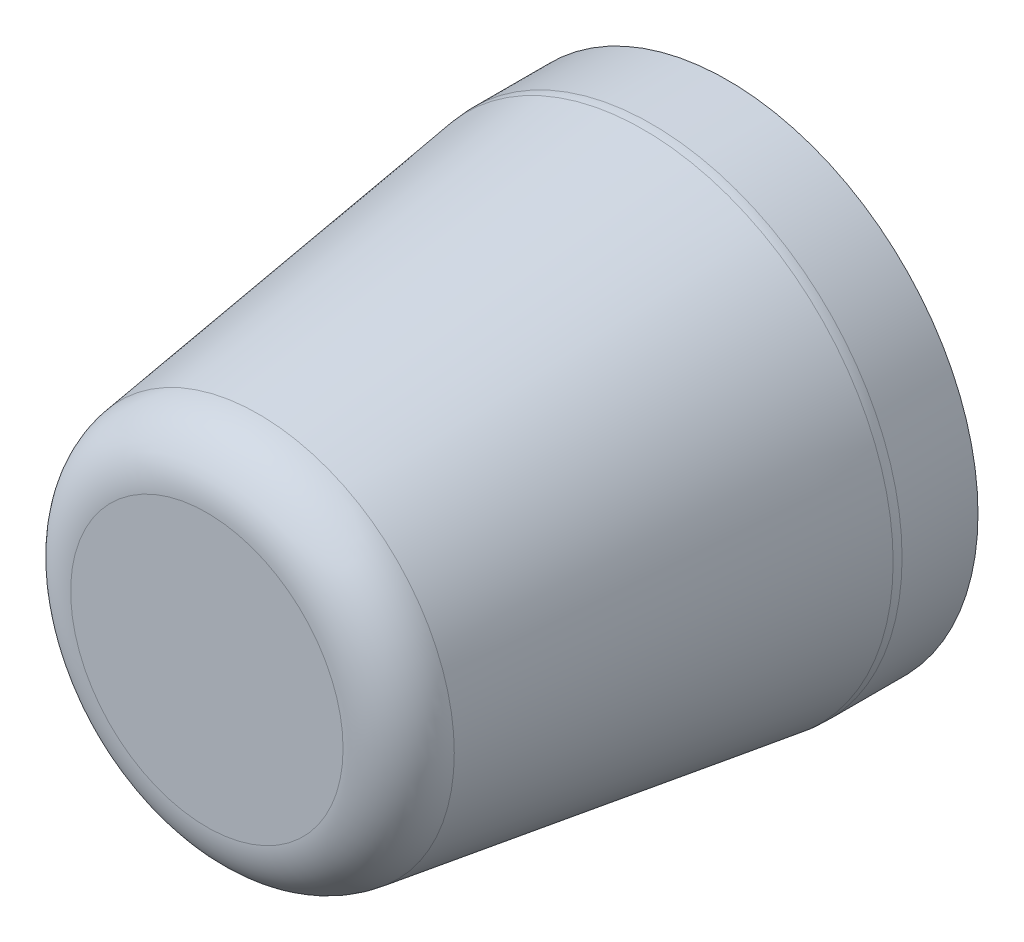
ISO-10303-21;
HEADER;
FILE_DESCRIPTION(('STEP AP214'),'2;1');
FILE_NAME('part.step','',(''),(''),'','','');
FILE_SCHEMA(('AUTOMOTIVE_DESIGN { 1 0 10303 214 1 1 1 1 }'));
ENDSEC;
DATA;
#1=APPLICATION_CONTEXT('core data for automotive mechanical design processes');
#2=APPLICATION_PROTOCOL_DEFINITION('international standard','automotive_design',2000,#1);
#3=PRODUCT_CONTEXT('',#1,'mechanical');
#4=PRODUCT('Part','Part','',(#3));
#5=PRODUCT_RELATED_PRODUCT_CATEGORY('part','',(#4));
#6=PRODUCT_DEFINITION_FORMATION('','',#4);
#7=PRODUCT_DEFINITION_CONTEXT('part definition',#1,'design');
#8=PRODUCT_DEFINITION('design','',#6,#7);
#9=PRODUCT_DEFINITION_SHAPE('','',#8);
#10=(LENGTH_UNIT() NAMED_UNIT(*) SI_UNIT(.MILLI.,.METRE.));
#11=(NAMED_UNIT(*) PLANE_ANGLE_UNIT() SI_UNIT($,.RADIAN.));
#12=(NAMED_UNIT(*) SI_UNIT($,.STERADIAN.) SOLID_ANGLE_UNIT());
#13=UNCERTAINTY_MEASURE_WITH_UNIT(LENGTH_MEASURE(1.E-05),#10,'distance_accuracy_value','');
#14=(GEOMETRIC_REPRESENTATION_CONTEXT(3) GLOBAL_UNCERTAINTY_ASSIGNED_CONTEXT((#13)) GLOBAL_UNIT_ASSIGNED_CONTEXT((#10,
#11,#12)) REPRESENTATION_CONTEXT('',''));
#15=CARTESIAN_POINT('',(0.,0.,0.));
#16=DIRECTION('',(0.,0.,1.));
#17=DIRECTION('',(1.,0.,0.));
#18=AXIS2_PLACEMENT_3D('',#15,#16,#17);
#19=CARTESIAN_POINT('',(0.,9.40810163654738,26.));
#20=DIRECTION('',(0.,0.,1.));
#21=DIRECTION('',(1.,0.,0.));
#22=AXIS2_PLACEMENT_3D('',#19,#20,#21);
#23=PLANE('',#22);
#24=CARTESIAN_POINT('',(0.,0.,26.));
#25=DIRECTION('',(0.,0.,1.));
#26=DIRECTION('',(1.,0.,0.));
#27=AXIS2_PLACEMENT_3D('',#24,#25,#26);
#28=CIRCLE('',#27,6.8002414230987);
#29=CARTESIAN_POINT('',(6.8002414230987,0.,26.));
#30=VERTEX_POINT('',#29);
#31=EDGE_CURVE('E22',#30,#30,#28,.T.);
#32=ORIENTED_EDGE('',*,*,#31,.T.);
#33=EDGE_LOOP('',(#32));
#34=FACE_BOUND('',#33,.T.);
#35=ADVANCED_FACE('F15',(#34),#23,.T.);
#36=CARTESIAN_POINT('',(0.,0.,15.));
#37=DIRECTION('',(0.,0.,-1.));
#38=DIRECTION('',(-1.,0.,0.));
#39=AXIS2_PLACEMENT_3D('',#36,#37,#38);
#40=PLANE('',#39);
#41=CARTESIAN_POINT('',(0.,0.,15.));
#42=DIRECTION('',(0.,0.,-1.));
#43=DIRECTION('',(-1.,0.,0.));
#44=AXIS2_PLACEMENT_3D('',#41,#42,#43);
#45=CIRCLE('',#44,2.);
#46=CARTESIAN_POINT('',(-2.,0.,15.));
#47=VERTEX_POINT('',#46);
#48=EDGE_CURVE('E35',#47,#47,#45,.T.);
#49=ORIENTED_EDGE('',*,*,#48,.T.);
#50=EDGE_LOOP('',(#49));
#51=FACE_BOUND('',#50,.T.);
#52=ADVANCED_FACE('F63',(#51),#40,.T.);
#53=CARTESIAN_POINT('',(0.,0.,0.));
#54=DIRECTION('',(0.,0.,-1.));
#55=DIRECTION('',(-1.,0.,0.));
#56=AXIS2_PLACEMENT_3D('',#53,#54,#55);
#57=CYLINDRICAL_SURFACE('',#56,2.);
#58=CARTESIAN_POINT('',(0.,0.,0.));
#59=DIRECTION('',(0.,0.,-1.));
#60=DIRECTION('',(-1.,0.,0.));
#61=AXIS2_PLACEMENT_3D('',#58,#59,#60);
#62=CIRCLE('',#61,2.);
#63=CARTESIAN_POINT('',(-2.,0.,0.));
#64=VERTEX_POINT('',#63);
#65=EDGE_CURVE('E38',#64,#64,#62,.T.);
#66=ORIENTED_EDGE('',*,*,#65,.T.);
#67=EDGE_LOOP('',(#66));
#68=FACE_BOUND('',#67,.T.);
#69=ORIENTED_EDGE('',*,*,#48,.F.);
#70=EDGE_LOOP('',(#69));
#71=FACE_BOUND('',#70,.T.);
#72=ADVANCED_FACE('F60',(#68,#71),#57,.F.);
#73=CARTESIAN_POINT('',(0.,2.,0.));
#74=DIRECTION('',(0.,0.,-1.));
#75=DIRECTION('',(-1.,0.,0.));
#76=AXIS2_PLACEMENT_3D('',#73,#74,#75);
#77=PLANE('',#76);
#78=CARTESIAN_POINT('',(0.,0.,0.));
#79=DIRECTION('',(0.,0.,-1.));
#80=DIRECTION('',(-1.,0.,0.));
#81=AXIS2_PLACEMENT_3D('',#78,#79,#80);
#82=CIRCLE('',#81,12.5);
#83=CARTESIAN_POINT('',(-12.5,0.,0.));
#84=VERTEX_POINT('',#83);
#85=EDGE_CURVE('E41',#84,#84,#82,.T.);
#86=ORIENTED_EDGE('',*,*,#85,.T.);
#87=EDGE_LOOP('',(#86));
#88=FACE_BOUND('',#87,.T.);
#89=ORIENTED_EDGE('',*,*,#65,.F.);
#90=EDGE_LOOP('',(#89));
#91=FACE_BOUND('',#90,.T.);
#92=ADVANCED_FACE('F45',(#88,#91),#77,.T.);
#93=CARTESIAN_POINT('',(0.,0.,0.));
#94=DIRECTION('',(0.,0.,-1.));
#95=DIRECTION('',(-1.,0.,0.));
#96=AXIS2_PLACEMENT_3D('',#93,#94,#95);
#97=CYLINDRICAL_SURFACE('',#96,12.5);
#98=CARTESIAN_POINT('',(0.,0.,3.79021956416948));
#99=DIRECTION('',(0.,0.,1.));
#100=DIRECTION('',(1.,0.,0.));
#101=AXIS2_PLACEMENT_3D('',#98,#99,#100);
#102=CIRCLE('',#101,12.5);
#103=CARTESIAN_POINT('',(12.5,0.,3.79021956416948));
#104=VERTEX_POINT('',#103);
#105=EDGE_CURVE('E10',#104,#104,#102,.F.);
#106=ORIENTED_EDGE('',*,*,#105,.T.);
#107=EDGE_LOOP('',(#106));
#108=FACE_BOUND('',#107,.T.);
#109=ORIENTED_EDGE('',*,*,#85,.F.);
#110=EDGE_LOOP('',(#109));
#111=FACE_BOUND('',#110,.T.);
#112=ADVANCED_FACE('F48',(#108,#111),#97,.T.);
#113=CARTESIAN_POINT('',(0.,0.,4.));
#114=DIRECTION('',(0.,0.,-1.));
#115=DIRECTION('',(-1.,0.,0.));
#116=AXIS2_PLACEMENT_3D('',#113,#114,#115);
#117=CONICAL_SURFACE('',#116,12.5,0.139626340159547);
#118=CARTESIAN_POINT('',(0.,0.,23.4175193028802));
#119=DIRECTION('',(0.,0.,1.));
#120=DIRECTION('',(1.,0.,0.));
#121=AXIS2_PLACEMENT_3D('',#118,#119,#120);
#122=CIRCLE('',#121,9.77104562932341);
#123=CARTESIAN_POINT('',(9.77104562932341,0.,23.4175193028802));
#124=VERTEX_POINT('',#123);
#125=EDGE_CURVE('E26',#124,#124,#122,.F.);
#126=ORIENTED_EDGE('',*,*,#125,.T.);
#127=EDGE_LOOP('',(#126));
#128=FACE_BOUND('',#127,.T.);
#129=CARTESIAN_POINT('',(0.,0.,4.20773886704966));
#130=DIRECTION('',(0.,0.,1.));
#131=DIRECTION('',(1.,0.,0.));
#132=AXIS2_PLACEMENT_3D('',#129,#130,#131);
#133=CIRCLE('',#132,12.4708042062247);
#134=CARTESIAN_POINT('',(12.4708042062247,0.,4.20773886704966));
#135=VERTEX_POINT('',#134);
#136=EDGE_CURVE('E30',#135,#135,#133,.T.);
#137=ORIENTED_EDGE('',*,*,#136,.T.);
#138=EDGE_LOOP('',(#137));
#139=FACE_BOUND('',#138,.T.);
#140=ADVANCED_FACE('F50',(#128,#139),#117,.T.);
#141=CARTESIAN_POINT('',(0.,0.,23.));
#142=DIRECTION('',(0.,0.,1.));
#143=DIRECTION('',(1.,0.,0.));
#144=AXIS2_PLACEMENT_3D('',#141,#142,#143);
#145=TOROIDAL_SURFACE('',#144,6.8002414230987,3.);
#146=ORIENTED_EDGE('',*,*,#31,.F.);
#147=EDGE_LOOP('',(#146));
#148=FACE_BOUND('',#147,.T.);
#149=ORIENTED_EDGE('',*,*,#125,.F.);
#150=EDGE_LOOP('',(#149));
#151=FACE_BOUND('',#150,.T.);
#152=ADVANCED_FACE('F57',(#148,#151),#145,.T.);
#153=CARTESIAN_POINT('',(0.,0.,3.79021956416948));
#154=DIRECTION('',(0.,0.,1.));
#155=DIRECTION('',(1.,0.,0.));
#156=AXIS2_PLACEMENT_3D('',#153,#154,#155);
#157=TOROIDAL_SURFACE('',#156,9.5,3.);
#158=ORIENTED_EDGE('',*,*,#136,.F.);
#159=EDGE_LOOP('',(#158));
#160=FACE_BOUND('',#159,.T.);
#161=ORIENTED_EDGE('',*,*,#105,.F.);
#162=EDGE_LOOP('',(#161));
#163=FACE_BOUND('',#162,.T.);
#164=ADVANCED_FACE('F17',(#160,#163),#157,.T.);
#165=CLOSED_SHELL('',(#35,#52,#72,#92,#112,#140,#152,#164));
#166=MANIFOLD_SOLID_BREP('B1',#165);
#167=ADVANCED_BREP_SHAPE_REPRESENTATION('',(#18,#166),#14);
#168=SHAPE_DEFINITION_REPRESENTATION(#9,#167);
ENDSEC;
END-ISO-10303-21;
